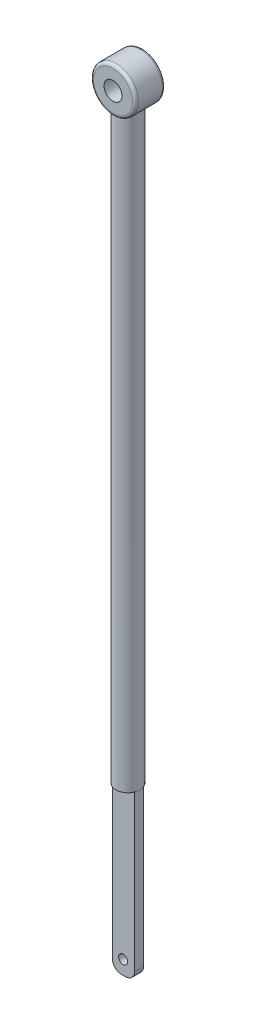
ISO-10303-21;
HEADER;
FILE_DESCRIPTION(('STEP AP214'),'2;1');
FILE_NAME('part.step','',(''),(''),'','','');
FILE_SCHEMA(('AUTOMOTIVE_DESIGN { 1 0 10303 214 1 1 1 1 }'));
ENDSEC;
DATA;
#1=APPLICATION_CONTEXT('core data for automotive mechanical design processes');
#2=APPLICATION_PROTOCOL_DEFINITION('international standard','automotive_design',2000,#1);
#3=PRODUCT_CONTEXT('',#1,'mechanical');
#4=PRODUCT('Part','Part','',(#3));
#5=PRODUCT_RELATED_PRODUCT_CATEGORY('part','',(#4));
#6=PRODUCT_DEFINITION_FORMATION('','',#4);
#7=PRODUCT_DEFINITION_CONTEXT('part definition',#1,'design');
#8=PRODUCT_DEFINITION('design','',#6,#7);
#9=PRODUCT_DEFINITION_SHAPE('','',#8);
#10=(LENGTH_UNIT() NAMED_UNIT(*) SI_UNIT(.MILLI.,.METRE.));
#11=(NAMED_UNIT(*) PLANE_ANGLE_UNIT() SI_UNIT($,.RADIAN.));
#12=(NAMED_UNIT(*) SI_UNIT($,.STERADIAN.) SOLID_ANGLE_UNIT());
#13=UNCERTAINTY_MEASURE_WITH_UNIT(LENGTH_MEASURE(1.E-05),#10,'distance_accuracy_value','');
#14=(GEOMETRIC_REPRESENTATION_CONTEXT(3) GLOBAL_UNCERTAINTY_ASSIGNED_CONTEXT((#13)) GLOBAL_UNIT_ASSIGNED_CONTEXT((#10,
#11,#12)) REPRESENTATION_CONTEXT('',''));
#15=CARTESIAN_POINT('',(0.,0.,0.));
#16=DIRECTION('',(0.,0.,1.));
#17=DIRECTION('',(1.,0.,0.));
#18=AXIS2_PLACEMENT_3D('',#15,#16,#17);
#19=CARTESIAN_POINT('',(0.75,-20.3,0.5));
#20=DIRECTION('',(0.,-1.,0.));
#21=DIRECTION('',(0.,0.,-1.));
#22=AXIS2_PLACEMENT_3D('',#19,#20,#21);
#23=PLANE('',#22);
#24=DIRECTION('',(0.,0.,1.));
#25=VECTOR('',#24,1.);
#26=CARTESIAN_POINT('',(1.12080992435478,-20.3,0.65));
#27=LINE('',#26,#25);
#28=CARTESIAN_POINT('',(1.12080992435478,-20.3,0.35));
#29=VERTEX_POINT('',#28);
#30=CARTESIAN_POINT('',(1.12080992435478,-20.3,0.65));
#31=VERTEX_POINT('',#30);
#32=EDGE_CURVE('E130',#29,#31,#27,.T.);
#33=ORIENTED_EDGE('',*,*,#32,.F.);
#34=CARTESIAN_POINT('',(0.75,-20.3,0.5));
#35=DIRECTION('',(0.,-1.,0.));
#36=DIRECTION('',(0.,0.,-1.));
#37=AXIS2_PLACEMENT_3D('',#34,#35,#36);
#38=CIRCLE('',#37,0.4);
#39=EDGE_CURVE('E124',#31,#29,#38,.F.);
#40=ORIENTED_EDGE('',*,*,#39,.F.);
#41=EDGE_LOOP('',(#33,#40));
#42=FACE_BOUND('',#41,.T.);
#43=ADVANCED_FACE('F33',(#42),#23,.T.);
#44=DIRECTION('',(1.,0.,0.));
#45=VECTOR('',#44,1.);
#46=CARTESIAN_POINT('',(0.379190075645216,-20.3,0.35));
#47=LINE('',#46,#45);
#48=CARTESIAN_POINT('',(0.379190075645216,-20.3,0.350000000000001));
#49=VERTEX_POINT('',#48);
#50=EDGE_CURVE('E126',#49,#29,#47,.T.);
#51=ORIENTED_EDGE('',*,*,#50,.F.);
#52=EDGE_CURVE('E115',#29,#49,#38,.F.);
#53=ORIENTED_EDGE('',*,*,#52,.F.);
#54=EDGE_LOOP('',(#51,#53));
#55=FACE_BOUND('',#54,.T.);
#56=ADVANCED_FACE('F180',(#55),#23,.T.);
#57=DIRECTION('',(0.,0.,-1.));
#58=VECTOR('',#57,1.);
#59=CARTESIAN_POINT('',(0.379190075645216,-20.3,0.65));
#60=LINE('',#59,#58);
#61=CARTESIAN_POINT('',(0.379190075645216,-20.3,0.65));
#62=VERTEX_POINT('',#61);
#63=EDGE_CURVE('E96',#62,#49,#60,.T.);
#64=ORIENTED_EDGE('',*,*,#63,.F.);
#65=EDGE_CURVE('E108',#49,#62,#38,.F.);
#66=ORIENTED_EDGE('',*,*,#65,.F.);
#67=EDGE_LOOP('',(#64,#66));
#68=FACE_BOUND('',#67,.T.);
#69=ADVANCED_FACE('F125',(#68),#23,.T.);
#70=CARTESIAN_POINT('',(0.75,-40.3,0.5));
#71=DIRECTION('',(0.,1.,0.));
#72=DIRECTION('',(0.,0.,1.));
#73=AXIS2_PLACEMENT_3D('',#70,#71,#72);
#74=CYLINDRICAL_SURFACE('',#73,0.4);
#75=CARTESIAN_POINT('',(0.75,-0.75,0.9));
#76=CARTESIAN_POINT('',(0.770857002146854,-0.749998792072245,0.89999864585511));
#77=CARTESIAN_POINT('',(0.791733645626958,-0.749120946801121,0.898359201793781));
#78=CARTESIAN_POINT('',(0.832859098667254,-0.745695648339856,0.891879149566976));
#79=CARTESIAN_POINT('',(0.853106884920574,-0.743145609346822,0.887033583498243));
#80=CARTESIAN_POINT('',(0.892319297472905,-0.736640184003269,0.874390080070844));
#81=CARTESIAN_POINT('',(0.911288756118786,-0.732690489957503,0.866604092905057));
#82=CARTESIAN_POINT('',(0.947617737114606,-0.72373874936185,0.848368724144006));
#83=CARTESIAN_POINT('',(0.964977252158131,-0.718736698036382,0.837919330462199));
#84=CARTESIAN_POINT('',(0.998883659729819,-0.707739503330157,0.813874219134124));
#85=CARTESIAN_POINT('',(1.01530101373159,-0.701700574053652,0.800116198240125));
#86=CARTESIAN_POINT('',(1.04571701533083,-0.689435210836337,0.770198427156626));
#87=CARTESIAN_POINT('',(1.05971354494818,-0.683208618244817,0.754036596633174));
#88=CARTESIAN_POINT('',(1.08617720975555,-0.670610703411309,0.718010970761121));
#89=CARTESIAN_POINT('',(1.09838841851337,-0.664277978506829,0.697943975668477));
#90=CARTESIAN_POINT('',(1.1192132081585,-0.652934193347739,0.655677159324419));
#91=CARTESIAN_POINT('',(1.12782956909677,-0.64792211289118,0.633479002596626));
#92=CARTESIAN_POINT('',(1.14062177583544,-0.640286974242617,0.588972865319354));
#93=CARTESIAN_POINT('',(1.1450415587124,-0.637534147826389,0.566758513954795));
#94=CARTESIAN_POINT('',(1.15004748620272,-0.634406655784712,0.521748064017123));
#95=CARTESIAN_POINT('',(1.15063847347978,-0.634028986076911,0.498952736932884));
#96=CARTESIAN_POINT('',(1.14814801082463,-0.635593244025676,0.45688906717668));
#97=CARTESIAN_POINT('',(1.14557161148835,-0.637216256781952,0.437575776688886));
#98=CARTESIAN_POINT('',(1.13770672753684,-0.642031586409658,0.399712688028998));
#99=CARTESIAN_POINT('',(1.13241715187877,-0.645224534573896,0.381163200247136));
#100=CARTESIAN_POINT('',(1.11919512619533,-0.652881389285395,0.344830986713219));
#101=CARTESIAN_POINT('',(1.11120597246544,-0.657372237002235,0.327074848457493));
#102=CARTESIAN_POINT('',(1.09285826148349,-0.667125235414448,0.293065236821301));
#103=CARTESIAN_POINT('',(1.08249865427185,-0.672387727526925,0.276812433815489));
#104=CARTESIAN_POINT('',(1.05793426121842,-0.684022624701227,0.243757069393363));
#105=CARTESIAN_POINT('',(1.04338814557995,-0.690444497466206,0.227224632376646));
#106=CARTESIAN_POINT('',(1.01172568668718,-0.703057793115616,0.196712321155026));
#107=CARTESIAN_POINT('',(0.994607786524731,-0.70924907355114,0.182734004603438));
#108=CARTESIAN_POINT('',(0.95701103851559,-0.721150054997669,0.156931142542897));
#109=CARTESIAN_POINT('',(0.936392742205395,-0.72680911544086,0.145284445903045));
#110=CARTESIAN_POINT('',(0.893113429868072,-0.736551976521276,0.125726058411549));
#111=CARTESIAN_POINT('',(0.870454258624779,-0.740637182508505,0.117811033998442));
#112=CARTESIAN_POINT('',(0.825916106977952,-0.74645497807115,0.10666119379636));
#113=CARTESIAN_POINT('',(0.804150065691015,-0.748366024962384,0.103069649345007));
#114=CARTESIAN_POINT('',(0.760244798770602,-0.750251105136009,0.0995262483997834));
#115=CARTESIAN_POINT('',(0.7381057963578,-0.750226258580454,0.0995722870988551));
#116=CARTESIAN_POINT('',(0.696227020119696,-0.748336911294161,0.103124964415337));
#117=CARTESIAN_POINT('',(0.676451775366134,-0.746639486221433,0.106317320374131));
#118=CARTESIAN_POINT('',(0.637765222584209,-0.741810941639232,0.115553721048959));
#119=CARTESIAN_POINT('',(0.618854004656377,-0.738679672982433,0.121598062428348));
#120=CARTESIAN_POINT('',(0.581874916238899,-0.731162854058446,0.136487471234114));
#121=CARTESIAN_POINT('',(0.563839833311565,-0.726747974811951,0.145398617459142));
#122=CARTESIAN_POINT('',(0.529468921294519,-0.717067190408805,0.165687577150801));
#123=CARTESIAN_POINT('',(0.513133758998637,-0.711800953359822,0.177066353188448));
#124=CARTESIAN_POINT('',(0.480755177696794,-0.700238228476767,0.203372400553865));
#125=CARTESIAN_POINT('',(0.464932567445874,-0.693891864834646,0.21854983366443));
#126=CARTESIAN_POINT('',(0.435945068629248,-0.681263542746564,0.251306417957578));
#127=CARTESIAN_POINT('',(0.422782642262644,-0.674981649029811,0.268887769146022));
#128=CARTESIAN_POINT('',(0.398629616845545,-0.662747571639826,0.307413243087514));
#129=CARTESIAN_POINT('',(0.387844877655412,-0.656846053645635,0.328504069389707));
#130=CARTESIAN_POINT('',(0.370087575911713,-0.64673967531484,0.372605045043085));
#131=CARTESIAN_POINT('',(0.363109584815259,-0.642532401188287,0.395612407060873));
#132=CARTESIAN_POINT('',(0.353852274096524,-0.636862567305093,0.440506923548771));
#133=CARTESIAN_POINT('',(0.351179694227378,-0.635171543413325,0.46228309185773));
#134=CARTESIAN_POINT('',(0.349448082744158,-0.634081799438209,0.50603015709018));
#135=CARTESIAN_POINT('',(0.35038658762998,-0.634681516597813,0.528000911061283));
#136=CARTESIAN_POINT('',(0.35547182462791,-0.637851238389165,0.568673177429027));
#137=CARTESIAN_POINT('',(0.359214704314798,-0.640172877762542,0.587447445363754));
#138=CARTESIAN_POINT('',(0.369253281760338,-0.646193458605361,0.624066978770534));
#139=CARTESIAN_POINT('',(0.375549926252008,-0.649892910816693,0.641911896942104));
#140=CARTESIAN_POINT('',(0.39095982394379,-0.658538327872148,0.677452389773278));
#141=CARTESIAN_POINT('',(0.400228396285183,-0.663549242059195,0.695064283707884));
#142=CARTESIAN_POINT('',(0.421164386661856,-0.674169803532215,0.728600967879876));
#143=CARTESIAN_POINT('',(0.432833096343317,-0.679779772417606,0.744524842679679));
#144=CARTESIAN_POINT('',(0.460208198683266,-0.691936349034138,0.776636546940146));
#145=CARTESIAN_POINT('',(0.47625449082391,-0.698501060375507,0.792529370224415));
#146=CARTESIAN_POINT('',(0.51092491772009,-0.711114150295361,0.821486135194045));
#147=CARTESIAN_POINT('',(0.529550708586587,-0.717162193092096,0.834548245551899));
#148=CARTESIAN_POINT('',(0.5694889986889,-0.728255075547606,0.857716979968329));
#149=CARTESIAN_POINT('',(0.590855667123045,-0.733272052962799,0.867744313212446));
#150=CARTESIAN_POINT('',(0.635300334184801,-0.741519282855872,0.883926811366937));
#151=CARTESIAN_POINT('',(0.658373576535683,-0.744754303573675,0.890092316061169));
#152=CARTESIAN_POINT('',(0.693096161046259,-0.747923880545734,0.896096335636036));
#153=CARTESIAN_POINT('',(0.70441112644023,-0.74869972157948,0.897557442100817));
#154=CARTESIAN_POINT('',(0.727148761276739,-0.749738115314596,0.899509651079264));
#155=CARTESIAN_POINT('',(0.738571432004634,-0.750000661882489,0.900000742001983));
#156=CARTESIAN_POINT('',(0.75,-0.75,0.9));
#157=B_SPLINE_CURVE_WITH_KNOTS('',3,(#75,#76,#77,#78,#79,#80,#81,#82,#83,#84,#85,#86,#87,#88,
#89,#90,#91,#92,#93,#94,#95,#96,#97,#98,#99,#100,#101,#102,#103,#104,#105,#106,#107,#108,#109,
#110,#111,#112,#113,#114,#115,#116,#117,#118,#119,#120,#121,#122,#123,#124,#125,#126,#127,#128,
#129,#130,#131,#132,#133,#134,#135,#136,#137,#138,#139,#140,#141,#142,#143,#144,#145,#146,#147,
#148,#149,#150,#151,#152,#153,#154,#155,#156),.UNSPECIFIED.,.T.,.F.,(4,2,2,2,2,2,2,2,2,2,2,2,2,
2,2,2,2,2,2,2,2,2,2,2,2,2,2,2,2,2,2,2,2,2,2,2,2,2,2,2,4),(0.,0.0625248929844959,
0.125146700289854,0.187516697715689,0.249886978181685,0.316379468758863,0.382929842559656,
0.455550105448427,0.528114103385951,0.59614150213347,0.664082842948356,0.72246409776063,
0.7808688477083,0.840585685980321,0.900329026379084,0.968850851382389,1.03741432656679,
1.11006114923391,1.1826429518099,1.2487008265959,1.31472047873337,1.37475162487968,
1.43478901683933,1.49632346013173,1.5578819500441,1.6260688629257,1.69431860173898,
1.76716292267372,1.8399030919489,1.90551893724446,1.97109002702102,2.02869044409135,
2.08631223436527,2.14764613192801,2.20901312340704,2.27925687949691,2.34954594495577,
2.42153832423377,2.49333711547483,2.52759714227211,2.56185757844817),.UNSPECIFIED.);
#158=CARTESIAN_POINT('',(0.75,-0.75,0.9));
#159=VERTEX_POINT('',#158);
#160=CARTESIAN_POINT('',(0.75,-0.75,0.1));
#161=VERTEX_POINT('',#160);
#162=EDGE_CURVE('E150',#159,#161,#157,.T.);
#163=ORIENTED_EDGE('',*,*,#162,.F.);
#164=EDGE_CURVE('E117',#161,#159,#157,.T.);
#165=ORIENTED_EDGE('',*,*,#164,.F.);
#166=EDGE_LOOP('',(#163,#165));
#167=FACE_BOUND('',#166,.T.);
#168=ORIENTED_EDGE('',*,*,#65,.T.);
#169=EDGE_CURVE('E112',#62,#31,#38,.F.);
#170=ORIENTED_EDGE('',*,*,#169,.T.);
#171=ORIENTED_EDGE('',*,*,#39,.T.);
#172=ORIENTED_EDGE('',*,*,#52,.T.);
#173=EDGE_LOOP('',(#168,#170,#171,#172));
#174=FACE_BOUND('',#173,.T.);
#175=ADVANCED_FACE('F110',(#167,#174),#74,.T.);
#176=CARTESIAN_POINT('',(0.75,0.,1.));
#177=DIRECTION('',(0.,0.,-1.));
#178=DIRECTION('',(-1.,0.,0.));
#179=AXIS2_PLACEMENT_3D('',#176,#177,#178);
#180=CYLINDRICAL_SURFACE('',#179,0.3);
#181=CARTESIAN_POINT('',(0.75,0.,1.));
#182=DIRECTION('',(0.,0.,1.));
#183=DIRECTION('',(1.,0.,0.));
#184=AXIS2_PLACEMENT_3D('',#181,#182,#183);
#185=CIRCLE('',#184,0.3);
#186=CARTESIAN_POINT('',(1.05,0.,1.));
#187=VERTEX_POINT('',#186);
#188=EDGE_CURVE('E151',#187,#187,#185,.T.);
#189=ORIENTED_EDGE('',*,*,#188,.T.);
#190=EDGE_LOOP('',(#189));
#191=FACE_BOUND('',#190,.T.);
#192=CARTESIAN_POINT('',(0.75,0.,0.));
#193=DIRECTION('',(0.,0.,1.));
#194=DIRECTION('',(1.,0.,0.));
#195=AXIS2_PLACEMENT_3D('',#192,#193,#194);
#196=CIRCLE('',#195,0.3);
#197=CARTESIAN_POINT('',(1.05,0.,0.));
#198=VERTEX_POINT('',#197);
#199=EDGE_CURVE('E291',#198,#198,#196,.T.);
#200=ORIENTED_EDGE('',*,*,#199,.F.);
#201=EDGE_LOOP('',(#200));
#202=FACE_BOUND('',#201,.T.);
#203=ADVANCED_FACE('F161',(#191,#202),#180,.F.);
#204=CARTESIAN_POINT('',(0.75,0.,1.));
#205=DIRECTION('',(0.,0.,-1.));
#206=DIRECTION('',(-1.,0.,0.));
#207=AXIS2_PLACEMENT_3D('',#204,#205,#206);
#208=CYLINDRICAL_SURFACE('',#207,0.75);
#209=CARTESIAN_POINT('',(0.75,0.,0.9));
#210=DIRECTION('',(0.,0.,1.));
#211=DIRECTION('',(1.,0.,0.));
#212=AXIS2_PLACEMENT_3D('',#209,#210,#211);
#213=CIRCLE('',#212,0.75);
#214=EDGE_CURVE('E289',#159,#159,#213,.F.);
#215=ORIENTED_EDGE('',*,*,#214,.T.);
#216=ORIENTED_EDGE('',*,*,#162,.T.);
#217=CARTESIAN_POINT('',(0.75,0.,0.1));
#218=DIRECTION('',(0.,0.,1.));
#219=DIRECTION('',(1.,0.,0.));
#220=AXIS2_PLACEMENT_3D('',#217,#218,#219);
#221=CIRCLE('',#220,0.75);
#222=EDGE_CURVE('E286',#161,#161,#221,.T.);
#223=ORIENTED_EDGE('',*,*,#222,.T.);
#224=ORIENTED_EDGE('',*,*,#164,.T.);
#225=EDGE_LOOP('',(#215,#216,#223,#224));
#226=FACE_BOUND('',#225,.T.);
#227=ADVANCED_FACE('F153',(#226),#208,.T.);
#228=CARTESIAN_POINT('',(0.75,-1.79142135623731,1.));
#229=DIRECTION('',(0.,0.,1.));
#230=DIRECTION('',(1.,0.,0.));
#231=AXIS2_PLACEMENT_3D('',#228,#229,#230);
#232=PLANE('',#231);
#233=CARTESIAN_POINT('',(0.75,0.,1.));
#234=DIRECTION('',(0.,0.,1.));
#235=DIRECTION('',(1.,0.,0.));
#236=AXIS2_PLACEMENT_3D('',#233,#234,#235);
#237=CIRCLE('',#236,0.65);
#238=CARTESIAN_POINT('',(1.4,0.,1.));
#239=VERTEX_POINT('',#238);
#240=EDGE_CURVE('E280',#239,#239,#237,.T.);
#241=ORIENTED_EDGE('',*,*,#240,.T.);
#242=EDGE_LOOP('',(#241));
#243=FACE_BOUND('',#242,.T.);
#244=ORIENTED_EDGE('',*,*,#188,.F.);
#245=EDGE_LOOP('',(#244));
#246=FACE_BOUND('',#245,.T.);
#247=ADVANCED_FACE('F164',(#243,#246),#232,.T.);
#248=CARTESIAN_POINT('',(0.75,-1.79142135623731,0.));
#249=DIRECTION('',(0.,0.,1.));
#250=DIRECTION('',(1.,0.,0.));
#251=AXIS2_PLACEMENT_3D('',#248,#249,#250);
#252=PLANE('',#251);
#253=CARTESIAN_POINT('',(0.75,0.,0.));
#254=DIRECTION('',(0.,0.,1.));
#255=DIRECTION('',(1.,0.,0.));
#256=AXIS2_PLACEMENT_3D('',#253,#254,#255);
#257=CIRCLE('',#256,0.65);
#258=CARTESIAN_POINT('',(1.4,0.,0.));
#259=VERTEX_POINT('',#258);
#260=EDGE_CURVE('E284',#259,#259,#257,.F.);
#261=ORIENTED_EDGE('',*,*,#260,.T.);
#262=EDGE_LOOP('',(#261));
#263=FACE_BOUND('',#262,.T.);
#264=ORIENTED_EDGE('',*,*,#199,.T.);
#265=EDGE_LOOP('',(#264));
#266=FACE_BOUND('',#265,.T.);
#267=ADVANCED_FACE('F166',(#263,#266),#252,.F.);
#268=CARTESIAN_POINT('',(0.75,0.,0.1));
#269=DIRECTION('',(0.,0.,1.));
#270=DIRECTION('',(1.,0.,0.));
#271=AXIS2_PLACEMENT_3D('',#268,#269,#270);
#272=TOROIDAL_SURFACE('',#271,0.65,0.1);
#273=ORIENTED_EDGE('',*,*,#260,.F.);
#274=EDGE_LOOP('',(#273));
#275=FACE_BOUND('',#274,.T.);
#276=ORIENTED_EDGE('',*,*,#222,.F.);
#277=EDGE_LOOP('',(#276));
#278=FACE_BOUND('',#277,.T.);
#279=ADVANCED_FACE('F169',(#275,#278),#272,.T.);
#280=CARTESIAN_POINT('',(0.75,0.,0.9));
#281=DIRECTION('',(0.,0.,1.));
#282=DIRECTION('',(1.,0.,0.));
#283=AXIS2_PLACEMENT_3D('',#280,#281,#282);
#284=TOROIDAL_SURFACE('',#283,0.65,0.1);
#285=ORIENTED_EDGE('',*,*,#214,.F.);
#286=EDGE_LOOP('',(#285));
#287=FACE_BOUND('',#286,.T.);
#288=ORIENTED_EDGE('',*,*,#240,.F.);
#289=EDGE_LOOP('',(#288));
#290=FACE_BOUND('',#289,.T.);
#291=ADVANCED_FACE('F174',(#287,#290),#284,.T.);
#292=DIRECTION('',(-1.,0.,0.));
#293=VECTOR('',#292,1.);
#294=CARTESIAN_POINT('',(0.379190075645216,-20.3,0.65));
#295=LINE('',#294,#293);
#296=EDGE_CURVE('E122',#31,#62,#295,.T.);
#297=ORIENTED_EDGE('',*,*,#296,.F.);
#298=ORIENTED_EDGE('',*,*,#169,.F.);
#299=EDGE_LOOP('',(#297,#298));
#300=FACE_BOUND('',#299,.T.);
#301=ADVANCED_FACE('F121',(#300),#23,.T.);
#302=CARTESIAN_POINT('',(1.12080992435478,-25.8,0.65));
#303=DIRECTION('',(-1.,0.,0.));
#304=DIRECTION('',(0.,0.,1.));
#305=AXIS2_PLACEMENT_3D('',#302,#303,#304);
#306=PLANE('',#305);
#307=DIRECTION('',(0.,1.,0.));
#308=VECTOR('',#307,1.);
#309=CARTESIAN_POINT('',(1.12080992435478,-25.8,0.65));
#310=LINE('',#309,#308);
#311=CARTESIAN_POINT('',(1.12080992435478,-25.5,0.65));
#312=VERTEX_POINT('',#311);
#313=EDGE_CURVE('E101',#312,#31,#310,.T.);
#314=ORIENTED_EDGE('',*,*,#313,.F.);
#315=DIRECTION('',(0.,0.,1.));
#316=VECTOR('',#315,1.);
#317=CARTESIAN_POINT('',(1.12080992435478,-25.5,0.35));
#318=LINE('',#317,#316);
#319=CARTESIAN_POINT('',(1.12080992435478,-25.5,0.35));
#320=VERTEX_POINT('',#319);
#321=EDGE_CURVE('E56',#312,#320,#318,.F.);
#322=ORIENTED_EDGE('',*,*,#321,.T.);
#323=DIRECTION('',(0.,1.,0.));
#324=VECTOR('',#323,1.);
#325=CARTESIAN_POINT('',(1.12080992435478,-25.8,0.35));
#326=LINE('',#325,#324);
#327=EDGE_CURVE('E139',#320,#29,#326,.T.);
#328=ORIENTED_EDGE('',*,*,#327,.T.);
#329=ORIENTED_EDGE('',*,*,#32,.T.);
#330=EDGE_LOOP('',(#314,#322,#328,#329));
#331=FACE_BOUND('',#330,.T.);
#332=ADVANCED_FACE('F189',(#331),#306,.F.);
#333=CARTESIAN_POINT('',(0.379190075645216,-25.8,0.65));
#334=DIRECTION('',(0.,0.,-1.));
#335=DIRECTION('',(-1.,0.,0.));
#336=AXIS2_PLACEMENT_3D('',#333,#334,#335);
#337=PLANE('',#336);
#338=CARTESIAN_POINT('',(0.737636393113306,-25.3363118068108,0.65));
#339=DIRECTION('',(0.,0.,-1.));
#340=DIRECTION('',(-1.,0.,0.));
#341=AXIS2_PLACEMENT_3D('',#338,#339,#340);
#342=CIRCLE('',#341,0.15);
#343=CARTESIAN_POINT('',(0.587636393113306,-25.3363118068108,0.65));
#344=VERTEX_POINT('',#343);
#345=EDGE_CURVE('E132',#344,#344,#342,.T.);
#346=ORIENTED_EDGE('',*,*,#345,.T.);
#347=EDGE_LOOP('',(#346));
#348=FACE_BOUND('',#347,.T.);
#349=DIRECTION('',(-1.,0.,0.));
#350=VECTOR('',#349,1.);
#351=CARTESIAN_POINT('',(0.379190075645216,-25.8,0.65));
#352=LINE('',#351,#350);
#353=CARTESIAN_POINT('',(0.820809924354783,-25.8,0.65));
#354=VERTEX_POINT('',#353);
#355=CARTESIAN_POINT('',(0.679190075645216,-25.8,0.65));
#356=VERTEX_POINT('',#355);
#357=EDGE_CURVE('E138',#354,#356,#352,.T.);
#358=ORIENTED_EDGE('',*,*,#357,.F.);
#359=CARTESIAN_POINT('',(0.820809924354783,-25.5,0.65));
#360=DIRECTION('',(0.,0.,-1.));
#361=DIRECTION('',(-1.,0.,0.));
#362=AXIS2_PLACEMENT_3D('',#359,#360,#361);
#363=CIRCLE('',#362,0.3);
#364=EDGE_CURVE('E273',#354,#312,#363,.F.);
#365=ORIENTED_EDGE('',*,*,#364,.T.);
#366=ORIENTED_EDGE('',*,*,#313,.T.);
#367=ORIENTED_EDGE('',*,*,#296,.T.);
#368=DIRECTION('',(0.,1.,0.));
#369=VECTOR('',#368,1.);
#370=CARTESIAN_POINT('',(0.379190075645216,-25.8,0.65));
#371=LINE('',#370,#369);
#372=CARTESIAN_POINT('',(0.379190075645216,-25.5,0.65));
#373=VERTEX_POINT('',#372);
#374=EDGE_CURVE('E92',#373,#62,#371,.T.);
#375=ORIENTED_EDGE('',*,*,#374,.F.);
#376=CARTESIAN_POINT('',(0.679190075645216,-25.5,0.65));
#377=DIRECTION('',(0.,0.,-1.));
#378=DIRECTION('',(-1.,0.,0.));
#379=AXIS2_PLACEMENT_3D('',#376,#377,#378);
#380=CIRCLE('',#379,0.3);
#381=EDGE_CURVE('E275',#373,#356,#380,.F.);
#382=ORIENTED_EDGE('',*,*,#381,.T.);
#383=EDGE_LOOP('',(#358,#365,#366,#367,#375,#382));
#384=FACE_BOUND('',#383,.T.);
#385=ADVANCED_FACE('F129',(#348,#384),#337,.F.);
#386=CARTESIAN_POINT('',(0.379190075645216,-25.8,0.65));
#387=DIRECTION('',(1.,0.,0.));
#388=DIRECTION('',(0.,0.,-1.));
#389=AXIS2_PLACEMENT_3D('',#386,#387,#388);
#390=PLANE('',#389);
#391=DIRECTION('',(0.,1.,0.));
#392=VECTOR('',#391,1.);
#393=CARTESIAN_POINT('',(0.379190075645216,-25.8,0.35));
#394=LINE('',#393,#392);
#395=CARTESIAN_POINT('',(0.379190075645216,-25.5,0.35));
#396=VERTEX_POINT('',#395);
#397=EDGE_CURVE('E102',#396,#49,#394,.T.);
#398=ORIENTED_EDGE('',*,*,#397,.F.);
#399=DIRECTION('',(0.,0.,-1.));
#400=VECTOR('',#399,1.);
#401=CARTESIAN_POINT('',(0.379190075645216,-25.5,0.65));
#402=LINE('',#401,#400);
#403=EDGE_CURVE('E11',#396,#373,#402,.F.);
#404=ORIENTED_EDGE('',*,*,#403,.T.);
#405=ORIENTED_EDGE('',*,*,#374,.T.);
#406=ORIENTED_EDGE('',*,*,#63,.T.);
#407=EDGE_LOOP('',(#398,#404,#405,#406));
#408=FACE_BOUND('',#407,.T.);
#409=ADVANCED_FACE('F94',(#408),#390,.F.);
#410=CARTESIAN_POINT('',(0.379190075645216,-25.8,0.35));
#411=DIRECTION('',(0.,0.,1.));
#412=DIRECTION('',(1.,0.,0.));
#413=AXIS2_PLACEMENT_3D('',#410,#411,#412);
#414=PLANE('',#413);
#415=CARTESIAN_POINT('',(0.737636393113306,-25.3363118068108,0.35));
#416=DIRECTION('',(0.,0.,-1.));
#417=DIRECTION('',(-1.,0.,0.));
#418=AXIS2_PLACEMENT_3D('',#415,#416,#417);
#419=CIRCLE('',#418,0.15);
#420=CARTESIAN_POINT('',(0.587636393113306,-25.3363118068108,0.35));
#421=VERTEX_POINT('',#420);
#422=EDGE_CURVE('E311',#421,#421,#419,.T.);
#423=ORIENTED_EDGE('',*,*,#422,.F.);
#424=EDGE_LOOP('',(#423));
#425=FACE_BOUND('',#424,.T.);
#426=ORIENTED_EDGE('',*,*,#327,.F.);
#427=CARTESIAN_POINT('',(0.820809924354783,-25.5,0.35));
#428=DIRECTION('',(0.,0.,1.));
#429=DIRECTION('',(1.,0.,0.));
#430=AXIS2_PLACEMENT_3D('',#427,#428,#429);
#431=CIRCLE('',#430,0.3);
#432=CARTESIAN_POINT('',(0.820809924354783,-25.8,0.35));
#433=VERTEX_POINT('',#432);
#434=EDGE_CURVE('E41',#320,#433,#431,.F.);
#435=ORIENTED_EDGE('',*,*,#434,.T.);
#436=DIRECTION('',(1.,0.,0.));
#437=VECTOR('',#436,1.);
#438=CARTESIAN_POINT('',(0.379190075645216,-25.8,0.35));
#439=LINE('',#438,#437);
#440=CARTESIAN_POINT('',(0.679190075645216,-25.8,0.35));
#441=VERTEX_POINT('',#440);
#442=EDGE_CURVE('E141',#441,#433,#439,.T.);
#443=ORIENTED_EDGE('',*,*,#442,.F.);
#444=CARTESIAN_POINT('',(0.679190075645216,-25.5,0.35));
#445=DIRECTION('',(0.,0.,1.));
#446=DIRECTION('',(1.,0.,0.));
#447=AXIS2_PLACEMENT_3D('',#444,#445,#446);
#448=CIRCLE('',#447,0.3);
#449=EDGE_CURVE('E48',#441,#396,#448,.F.);
#450=ORIENTED_EDGE('',*,*,#449,.T.);
#451=ORIENTED_EDGE('',*,*,#397,.T.);
#452=ORIENTED_EDGE('',*,*,#50,.T.);
#453=EDGE_LOOP('',(#426,#435,#443,#450,#451,#452));
#454=FACE_BOUND('',#453,.T.);
#455=ADVANCED_FACE('F306',(#425,#454),#414,.F.);
#456=CARTESIAN_POINT('',(1.12080992435478,-25.8,0.35));
#457=DIRECTION('',(0.,-1.,0.));
#458=DIRECTION('',(0.,0.,-1.));
#459=AXIS2_PLACEMENT_3D('',#456,#457,#458);
#460=PLANE('',#459);
#461=ORIENTED_EDGE('',*,*,#442,.T.);
#462=DIRECTION('',(0.,0.,1.));
#463=VECTOR('',#462,1.);
#464=CARTESIAN_POINT('',(0.820809924354783,-25.8,0.65));
#465=LINE('',#464,#463);
#466=EDGE_CURVE('E268',#433,#354,#465,.T.);
#467=ORIENTED_EDGE('',*,*,#466,.T.);
#468=ORIENTED_EDGE('',*,*,#357,.T.);
#469=DIRECTION('',(0.,0.,-1.));
#470=VECTOR('',#469,1.);
#471=CARTESIAN_POINT('',(0.679190075645216,-25.8,0.35));
#472=LINE('',#471,#470);
#473=EDGE_CURVE('E278',#356,#441,#472,.T.);
#474=ORIENTED_EDGE('',*,*,#473,.T.);
#475=EDGE_LOOP('',(#461,#467,#468,#474));
#476=FACE_BOUND('',#475,.T.);
#477=ADVANCED_FACE('F262',(#476),#460,.T.);
#478=CARTESIAN_POINT('',(0.737636393113306,-25.3363118068108,5.85));
#479=DIRECTION('',(0.,0.,-1.));
#480=DIRECTION('',(-1.,0.,0.));
#481=AXIS2_PLACEMENT_3D('',#478,#479,#480);
#482=CYLINDRICAL_SURFACE('',#481,0.15);
#483=ORIENTED_EDGE('',*,*,#422,.T.);
#484=EDGE_LOOP('',(#483));
#485=FACE_BOUND('',#484,.T.);
#486=ORIENTED_EDGE('',*,*,#345,.F.);
#487=EDGE_LOOP('',(#486));
#488=FACE_BOUND('',#487,.T.);
#489=ADVANCED_FACE('F255',(#485,#488),#482,.F.);
#490=CARTESIAN_POINT('',(0.820809924354783,-25.5,0.35));
#491=DIRECTION('',(0.,0.,-1.));
#492=DIRECTION('',(-1.,0.,0.));
#493=AXIS2_PLACEMENT_3D('',#490,#491,#492);
#494=CYLINDRICAL_SURFACE('',#493,0.3);
#495=ORIENTED_EDGE('',*,*,#434,.F.);
#496=ORIENTED_EDGE('',*,*,#321,.F.);
#497=ORIENTED_EDGE('',*,*,#364,.F.);
#498=ORIENTED_EDGE('',*,*,#466,.F.);
#499=EDGE_LOOP('',(#495,#496,#497,#498));
#500=FACE_BOUND('',#499,.T.);
#501=ADVANCED_FACE('F253',(#500),#494,.T.);
#502=CARTESIAN_POINT('',(0.679190075645216,-25.5,0.35));
#503=DIRECTION('',(0.,0.,1.));
#504=DIRECTION('',(1.,0.,0.));
#505=AXIS2_PLACEMENT_3D('',#502,#503,#504);
#506=CYLINDRICAL_SURFACE('',#505,0.3);
#507=ORIENTED_EDGE('',*,*,#381,.F.);
#508=ORIENTED_EDGE('',*,*,#403,.F.);
#509=ORIENTED_EDGE('',*,*,#449,.F.);
#510=ORIENTED_EDGE('',*,*,#473,.F.);
#511=EDGE_LOOP('',(#507,#508,#509,#510));
#512=FACE_BOUND('',#511,.T.);
#513=ADVANCED_FACE('F35',(#512),#506,.T.);
#514=CLOSED_SHELL('',(#43,#56,#69,#175,#203,#227,#247,#267,#279,#291,#301,#332,#385,#409,#455,
#477,#489,#501,#513));
#515=MANIFOLD_SOLID_BREP('B2',#514);
#516=ADVANCED_BREP_SHAPE_REPRESENTATION('',(#18,#515),#14);
#517=SHAPE_DEFINITION_REPRESENTATION(#9,#516);
ENDSEC;
END-ISO-10303-21;
